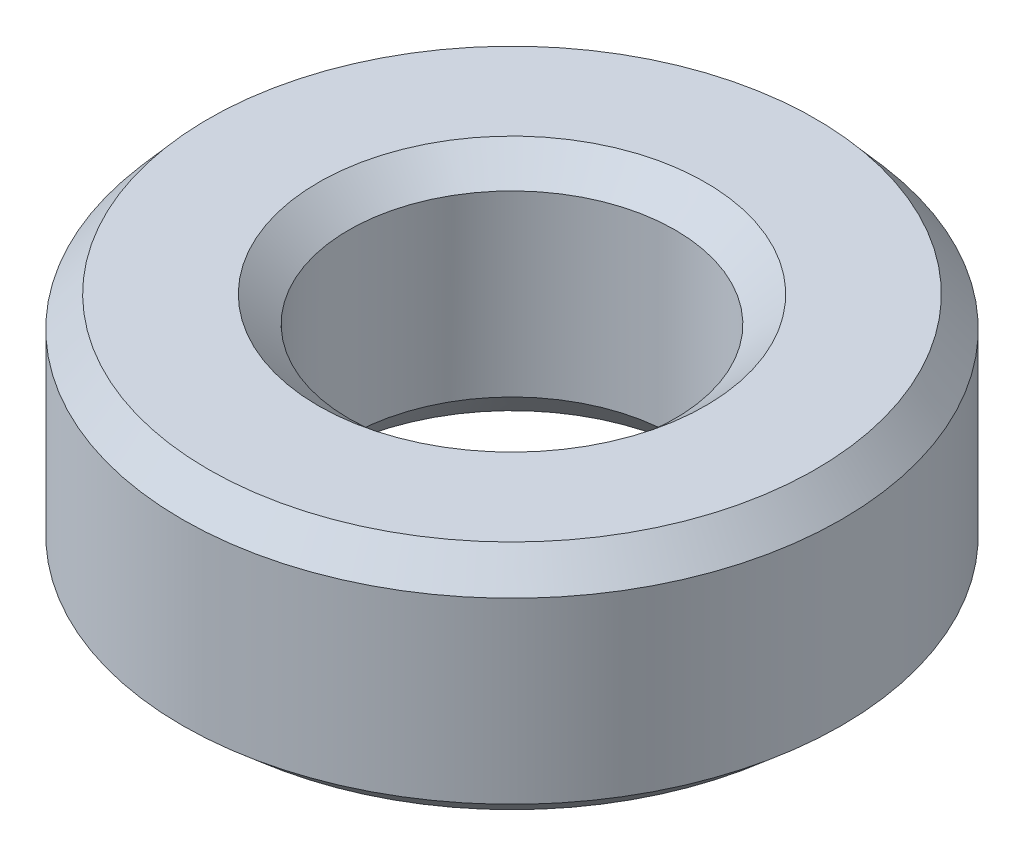
ISO-10303-21;
HEADER;
FILE_DESCRIPTION(('STEP AP214'),'2;1');
FILE_NAME('part.step','',(''),(''),'','','');
FILE_SCHEMA(('AUTOMOTIVE_DESIGN { 1 0 10303 214 1 1 1 1 }'));
ENDSEC;
DATA;
#1=APPLICATION_CONTEXT('core data for automotive mechanical design processes');
#2=APPLICATION_PROTOCOL_DEFINITION('international standard','automotive_design',2000,#1);
#3=PRODUCT_CONTEXT('',#1,'mechanical');
#4=PRODUCT('Part','Part','',(#3));
#5=PRODUCT_RELATED_PRODUCT_CATEGORY('part','',(#4));
#6=PRODUCT_DEFINITION_FORMATION('','',#4);
#7=PRODUCT_DEFINITION_CONTEXT('part definition',#1,'design');
#8=PRODUCT_DEFINITION('design','',#6,#7);
#9=PRODUCT_DEFINITION_SHAPE('','',#8);
#10=(LENGTH_UNIT() NAMED_UNIT(*) SI_UNIT(.MILLI.,.METRE.));
#11=(NAMED_UNIT(*) PLANE_ANGLE_UNIT() SI_UNIT($,.RADIAN.));
#12=(NAMED_UNIT(*) SI_UNIT($,.STERADIAN.) SOLID_ANGLE_UNIT());
#13=UNCERTAINTY_MEASURE_WITH_UNIT(LENGTH_MEASURE(1.E-05),#10,'distance_accuracy_value','');
#14=(GEOMETRIC_REPRESENTATION_CONTEXT(3) GLOBAL_UNCERTAINTY_ASSIGNED_CONTEXT((#13)) GLOBAL_UNIT_ASSIGNED_CONTEXT((#10,
#11,#12)) REPRESENTATION_CONTEXT('',''));
#15=CARTESIAN_POINT('',(0.,0.,0.));
#16=DIRECTION('',(0.,0.,1.));
#17=DIRECTION('',(1.,0.,0.));
#18=AXIS2_PLACEMENT_3D('',#15,#16,#17);
#19=CARTESIAN_POINT('',(0.,19.5849321137622,0.));
#20=DIRECTION('',(0.,-1.,0.));
#21=DIRECTION('',(0.,0.,-1.));
#22=AXIS2_PLACEMENT_3D('',#19,#20,#21);
#23=CYLINDRICAL_SURFACE('',#22,27.5);
#24=CARTESIAN_POINT('',(0.,2.17509731785289,0.));
#25=DIRECTION('',(0.,1.,0.));
#26=DIRECTION('',(0.,0.,1.));
#27=AXIS2_PLACEMENT_3D('',#24,#25,#26);
#28=CIRCLE('',#27,27.5);
#29=CARTESIAN_POINT('',(0.,2.17509731785289,27.5));
#30=VERTEX_POINT('',#29);
#31=EDGE_CURVE('E10',#30,#30,#28,.T.);
#32=ORIENTED_EDGE('',*,*,#31,.T.);
#33=EDGE_LOOP('',(#32));
#34=FACE_BOUND('',#33,.T.);
#35=CARTESIAN_POINT('',(0.,17.0584941588861,0.));
#36=DIRECTION('',(0.,1.,0.));
#37=DIRECTION('',(0.,0.,1.));
#38=AXIS2_PLACEMENT_3D('',#35,#36,#37);
#39=CIRCLE('',#38,27.5);
#40=CARTESIAN_POINT('',(0.,17.0584941588861,27.5));
#41=VERTEX_POINT('',#40);
#42=EDGE_CURVE('E50',#41,#41,#39,.F.);
#43=ORIENTED_EDGE('',*,*,#42,.T.);
#44=EDGE_LOOP('',(#43));
#45=FACE_BOUND('',#44,.T.);
#46=ADVANCED_FACE('F39',(#34,#45),#23,.T.);
#47=CARTESIAN_POINT('',(0.,19.5849321137622,0.));
#48=DIRECTION('',(0.,1.,0.));
#49=DIRECTION('',(0.,0.,1.));
#50=AXIS2_PLACEMENT_3D('',#47,#48,#49);
#51=PLANE('',#50);
#52=CARTESIAN_POINT('',(0.,19.5849321137622,0.));
#53=DIRECTION('',(0.,1.,0.));
#54=DIRECTION('',(0.,0.,1.));
#55=AXIS2_PLACEMENT_3D('',#52,#53,#54);
#56=CIRCLE('',#55,16.1440527768047);
#57=CARTESIAN_POINT('',(0.,19.5849321137622,16.1440527768047));
#58=VERTEX_POINT('',#57);
#59=EDGE_CURVE('E58',#58,#58,#56,.F.);
#60=ORIENTED_EDGE('',*,*,#59,.T.);
#61=EDGE_LOOP('',(#60));
#62=FACE_BOUND('',#61,.T.);
#63=CARTESIAN_POINT('',(0.,19.5849321137622,0.));
#64=DIRECTION('',(0.,1.,0.));
#65=DIRECTION('',(0.,0.,1.));
#66=AXIS2_PLACEMENT_3D('',#63,#64,#65);
#67=CIRCLE('',#66,25.3249026821471);
#68=CARTESIAN_POINT('',(0.,19.5849321137622,25.3249026821471));
#69=VERTEX_POINT('',#68);
#70=EDGE_CURVE('E61',#69,#69,#67,.T.);
#71=ORIENTED_EDGE('',*,*,#70,.T.);
#72=EDGE_LOOP('',(#71));
#73=FACE_BOUND('',#72,.T.);
#74=ADVANCED_FACE('F88',(#62,#73),#51,.T.);
#75=CARTESIAN_POINT('',(0.,0.,0.));
#76=DIRECTION('',(0.,1.,0.));
#77=DIRECTION('',(0.,0.,1.));
#78=AXIS2_PLACEMENT_3D('',#75,#76,#77);
#79=PLANE('',#78);
#80=CARTESIAN_POINT('',(0.,0.,0.));
#81=DIRECTION('',(0.,1.,0.));
#82=DIRECTION('',(0.,0.,1.));
#83=AXIS2_PLACEMENT_3D('',#80,#81,#82);
#84=CIRCLE('',#83,15.7927121397815);
#85=CARTESIAN_POINT('',(0.,0.,-15.7927121397815));
#86=VERTEX_POINT('',#85);
#87=EDGE_CURVE('E51',#86,#86,#84,.T.);
#88=ORIENTED_EDGE('',*,*,#87,.T.);
#89=EDGE_LOOP('',(#88));
#90=FACE_BOUND('',#89,.T.);
#91=CARTESIAN_POINT('',(0.,0.,0.));
#92=DIRECTION('',(0.,1.,0.));
#93=DIRECTION('',(0.,0.,1.));
#94=AXIS2_PLACEMENT_3D('',#91,#92,#93);
#95=CIRCLE('',#94,24.9735620451239);
#96=CARTESIAN_POINT('',(0.,0.,24.9735620451239));
#97=VERTEX_POINT('',#96);
#98=EDGE_CURVE('E54',#97,#97,#95,.F.);
#99=ORIENTED_EDGE('',*,*,#98,.T.);
#100=EDGE_LOOP('',(#99));
#101=FACE_BOUND('',#100,.T.);
#102=ADVANCED_FACE('F83',(#90,#101),#79,.F.);
#103=CARTESIAN_POINT('',(0.,19.5849321137622,0.));
#104=DIRECTION('',(0.,-1.,0.));
#105=DIRECTION('',(0.,0.,-1.));
#106=AXIS2_PLACEMENT_3D('',#103,#104,#105);
#107=CYLINDRICAL_SURFACE('',#106,13.6176148219286);
#108=CARTESIAN_POINT('',(0.,17.4098347959093,0.));
#109=DIRECTION('',(0.,1.,0.));
#110=DIRECTION('',(0.,0.,1.));
#111=AXIS2_PLACEMENT_3D('',#108,#109,#110);
#112=CIRCLE('',#111,13.6176148219286);
#113=CARTESIAN_POINT('',(0.,17.4098347959093,13.6176148219286));
#114=VERTEX_POINT('',#113);
#115=EDGE_CURVE('E67',#114,#114,#112,.T.);
#116=ORIENTED_EDGE('',*,*,#115,.T.);
#117=EDGE_LOOP('',(#116));
#118=FACE_BOUND('',#117,.T.);
#119=CARTESIAN_POINT('',(0.,2.52643795487613,0.));
#120=DIRECTION('',(0.,1.,0.));
#121=DIRECTION('',(0.,0.,1.));
#122=AXIS2_PLACEMENT_3D('',#119,#120,#121);
#123=CIRCLE('',#122,13.6176148219286);
#124=CARTESIAN_POINT('',(0.,2.52643795487613,-13.6176148219286));
#125=VERTEX_POINT('',#124);
#126=EDGE_CURVE('E69',#125,#125,#123,.F.);
#127=ORIENTED_EDGE('',*,*,#126,.T.);
#128=EDGE_LOOP('',(#127));
#129=FACE_BOUND('',#128,.T.);
#130=ADVANCED_FACE('F71',(#118,#129),#107,.F.);
#131=CARTESIAN_POINT('',(0.,17.4098347959093,0.));
#132=DIRECTION('',(0.,1.,0.));
#133=DIRECTION('',(0.,0.,1.));
#134=AXIS2_PLACEMENT_3D('',#131,#132,#133);
#135=CONICAL_SURFACE('',#134,13.6176148219286,0.859988438523563);
#136=ORIENTED_EDGE('',*,*,#59,.F.);
#137=EDGE_LOOP('',(#136));
#138=FACE_BOUND('',#137,.T.);
#139=ORIENTED_EDGE('',*,*,#115,.F.);
#140=EDGE_LOOP('',(#139));
#141=FACE_BOUND('',#140,.T.);
#142=ADVANCED_FACE('F77',(#138,#141),#135,.F.);
#143=CARTESIAN_POINT('',(0.,0.,0.));
#144=DIRECTION('',(0.,-1.,0.));
#145=DIRECTION('',(0.,0.,-1.));
#146=AXIS2_PLACEMENT_3D('',#143,#144,#145);
#147=CONICAL_SURFACE('',#146,15.7927121397815,0.710807888271333);
#148=CARTESIAN_POINT('',(0.,2.52643795487613,-13.6176148219286));
#149=CARTESIAN_POINT('',(0.,2.50012089284617,-13.6402720856562));
#150=CARTESIAN_POINT('',(0.,2.47380383081621,-13.6629293493839));
#151=CARTESIAN_POINT('',(0.,2.42116970675629,-13.7082438768391));
#152=CARTESIAN_POINT('',(0.,2.39485264472633,-13.7309011405668));
#153=CARTESIAN_POINT('',(0.,2.34221852066641,-13.776215668022));
#154=CARTESIAN_POINT('',(0.,2.31590145863645,-13.7988729317497));
#155=CARTESIAN_POINT('',(0.,2.26326733457653,-13.8441874592049));
#156=CARTESIAN_POINT('',(0.,2.23695027254657,-13.8668447229326));
#157=CARTESIAN_POINT('',(0.,2.18431614848665,-13.9121592503878));
#158=CARTESIAN_POINT('',(0.,2.15799908645669,-13.9348165141155));
#159=CARTESIAN_POINT('',(0.,2.10536496239677,-13.9801310415708));
#160=CARTESIAN_POINT('',(0.,2.07904790036681,-14.0027883052984));
#161=CARTESIAN_POINT('',(0.,2.02641377630689,-14.0481028327537));
#162=CARTESIAN_POINT('',(0.,2.00009671427694,-14.0707600964813));
#163=CARTESIAN_POINT('',(0.,1.94746259021702,-14.1160746239366));
#164=CARTESIAN_POINT('',(0.,1.92114552818706,-14.1387318876642));
#165=CARTESIAN_POINT('',(0.,1.86851140412714,-14.1840464151195));
#166=CARTESIAN_POINT('',(0.,1.84219434209718,-14.2067036788471));
#167=CARTESIAN_POINT('',(0.,1.78956021803726,-14.2520182063024));
#168=CARTESIAN_POINT('',(0.,1.7632431560073,-14.27467547003));
#169=CARTESIAN_POINT('',(0.,1.71060903194738,-14.3199899974853));
#170=CARTESIAN_POINT('',(0.,1.68429196991742,-14.3426472612129));
#171=CARTESIAN_POINT('',(0.,1.6316578458575,-14.3879617886682));
#172=CARTESIAN_POINT('',(0.,1.60534078382754,-14.4106190523958));
#173=CARTESIAN_POINT('',(0.,1.55270665976762,-14.4559335798511));
#174=CARTESIAN_POINT('',(0.,1.52638959773766,-14.4785908435787));
#175=CARTESIAN_POINT('',(0.,1.47375547367774,-14.523905371034));
#176=CARTESIAN_POINT('',(0.,1.44743841164778,-14.5465626347616));
#177=CARTESIAN_POINT('',(0.,1.39480428758786,-14.5918771622169));
#178=CARTESIAN_POINT('',(0.,1.3684872255579,-14.6145344259445));
#179=CARTESIAN_POINT('',(0.,1.31585310149798,-14.6598489533998));
#180=CARTESIAN_POINT('',(0.,1.28953603946802,-14.6825062171274));
#181=CARTESIAN_POINT('',(0.,1.2369019154081,-14.7278207445827));
#182=CARTESIAN_POINT('',(0.,1.21058485337815,-14.7504780083103));
#183=CARTESIAN_POINT('',(0.,1.15795072931823,-14.7957925357656));
#184=CARTESIAN_POINT('',(0.,1.13163366728827,-14.8184497994932));
#185=CARTESIAN_POINT('',(0.,1.07899954322835,-14.8637643269485));
#186=CARTESIAN_POINT('',(0.,1.05268248119839,-14.8864215906761));
#187=CARTESIAN_POINT('',(0.,1.00004835713847,-14.9317361181314));
#188=CARTESIAN_POINT('',(0.,0.973731295108508,-14.954393381859));
#189=CARTESIAN_POINT('',(0.,0.921097171048588,-14.9997079093143));
#190=CARTESIAN_POINT('',(0.,0.894780109018629,-15.0223651730419));
#191=CARTESIAN_POINT('',(0.,0.84214598495871,-15.0676797004972));
#192=CARTESIAN_POINT('',(0.,0.81582892292875,-15.0903369642248));
#193=CARTESIAN_POINT('',(0.,0.76319479886883,-15.1356514916801));
#194=CARTESIAN_POINT('',(0.,0.736877736838871,-15.1583087554077));
#195=CARTESIAN_POINT('',(0.,0.684243612778952,-15.203623282863));
#196=CARTESIAN_POINT('',(0.,0.657926550748992,-15.2262805465906));
#197=CARTESIAN_POINT('',(0.,0.605292426689072,-15.2715950740459));
#198=CARTESIAN_POINT('',(0.,0.578975364659113,-15.2942523377735));
#199=CARTESIAN_POINT('',(0.,0.526341240599194,-15.3395668652288));
#200=CARTESIAN_POINT('',(0.,0.500024178569234,-15.3622241289564));
#201=CARTESIAN_POINT('',(0.,0.447390054509314,-15.4075386564117));
#202=CARTESIAN_POINT('',(0.,0.421072992479355,-15.4301959201394));
#203=CARTESIAN_POINT('',(0.,0.368438868419436,-15.4755104475946));
#204=CARTESIAN_POINT('',(0.,0.342121806389476,-15.4981677113223));
#205=CARTESIAN_POINT('',(0.,0.289487682329556,-15.5434822387775));
#206=CARTESIAN_POINT('',(0.,0.263170620299597,-15.5661395025052));
#207=CARTESIAN_POINT('',(0.,0.210536496239678,-15.6114540299604));
#208=CARTESIAN_POINT('',(0.,0.184219434209718,-15.6341112936881));
#209=CARTESIAN_POINT('',(0.,0.131585310149799,-15.6794258211433));
#210=CARTESIAN_POINT('',(0.,0.105268248119839,-15.702083084871));
#211=CARTESIAN_POINT('',(0.,0.0526341240599188,-15.7473976123262));
#212=CARTESIAN_POINT('',(0.,0.0263170620299589,-15.7700548760539));
#213=CARTESIAN_POINT('',(0.,0.,-15.7927121397815));
#214=B_SPLINE_CURVE_WITH_KNOTS('',3,(#148,#149,#150,#151,#152,#153,#154,#155,#156,#157,#158,
#159,#160,#161,#162,#163,#164,#165,#166,#167,#168,#169,#170,#171,#172,#173,#174,#175,#176,#177,
#178,#179,#180,#181,#182,#183,#184,#185,#186,#187,#188,#189,#190,#191,#192,#193,#194,#195,#196,
#197,#198,#199,#200,#201,#202,#203,#204,#205,#206,#207,#208,#209,#210,#211,#212,#213),
.UNSPECIFIED.,.F.,.F.,(4,2,2,2,2,2,2,2,2,2,2,2,2,2,2,2,2,2,2,2,2,2,2,2,2,2,2,2,2,2,2,2,4),(0.,
0.104179912562888,0.208359825125775,0.312539737688663,0.41671965025155,0.520899562814438,
0.625079475377325,0.729259387940213,0.8334393005031,0.937619213065988,1.04179912562887,
1.14597903819176,1.25015895075465,1.35433886331754,1.45851877588042,1.56269868844331,
1.6668786010062,1.77105851356909,1.87523842613197,1.97941833869486,2.08359825125775,
2.18777816382064,2.29195807638352,2.39613798894641,2.5003179015093,2.60449781407219,
2.70867772663507,2.81285763919796,2.91703755176085,3.02121746432374,3.12539737688663,
3.22957728944951,3.3337572020124),.UNSPECIFIED.);
#215=EDGE_CURVE('BSEAM73',#125,#86,#214,.T.);
#216=ORIENTED_EDGE('',*,*,#126,.F.);
#217=ORIENTED_EDGE('',*,*,#87,.F.);
#218=ORIENTED_EDGE('',*,*,#215,.T.);
#219=ORIENTED_EDGE('',*,*,#215,.F.);
#220=EDGE_LOOP('',(#216,#218,#217,#219));
#221=FACE_BOUND('',#220,.T.);
#222=ADVANCED_FACE('F73',(#221),#147,.F.);
#223=CARTESIAN_POINT('',(0.,2.17509731785289,0.));
#224=DIRECTION('',(0.,1.,0.));
#225=DIRECTION('',(0.,0.,1.));
#226=AXIS2_PLACEMENT_3D('',#223,#224,#225);
#227=CONICAL_SURFACE('',#226,27.5,0.85998843852356);
#228=ORIENTED_EDGE('',*,*,#98,.F.);
#229=EDGE_LOOP('',(#228));
#230=FACE_BOUND('',#229,.T.);
#231=ORIENTED_EDGE('',*,*,#31,.F.);
#232=EDGE_LOOP('',(#231));
#233=FACE_BOUND('',#232,.T.);
#234=ADVANCED_FACE('F76',(#230,#233),#227,.T.);
#235=CARTESIAN_POINT('',(0.,19.5849321137622,0.));
#236=DIRECTION('',(0.,-1.,0.));
#237=DIRECTION('',(0.,0.,-1.));
#238=AXIS2_PLACEMENT_3D('',#235,#236,#237);
#239=CONICAL_SURFACE('',#238,25.3249026821471,0.710807888271336);
#240=ORIENTED_EDGE('',*,*,#42,.F.);
#241=EDGE_LOOP('',(#240));
#242=FACE_BOUND('',#241,.T.);
#243=ORIENTED_EDGE('',*,*,#70,.F.);
#244=EDGE_LOOP('',(#243));
#245=FACE_BOUND('',#244,.T.);
#246=ADVANCED_FACE('F45',(#242,#245),#239,.T.);
#247=CLOSED_SHELL('',(#46,#74,#102,#130,#142,#222,#234,#246));
#248=MANIFOLD_SOLID_BREP('B2',#247);
#249=ADVANCED_BREP_SHAPE_REPRESENTATION('',(#18,#248),#14);
#250=SHAPE_DEFINITION_REPRESENTATION(#9,#249);
ENDSEC;
END-ISO-10303-21;
